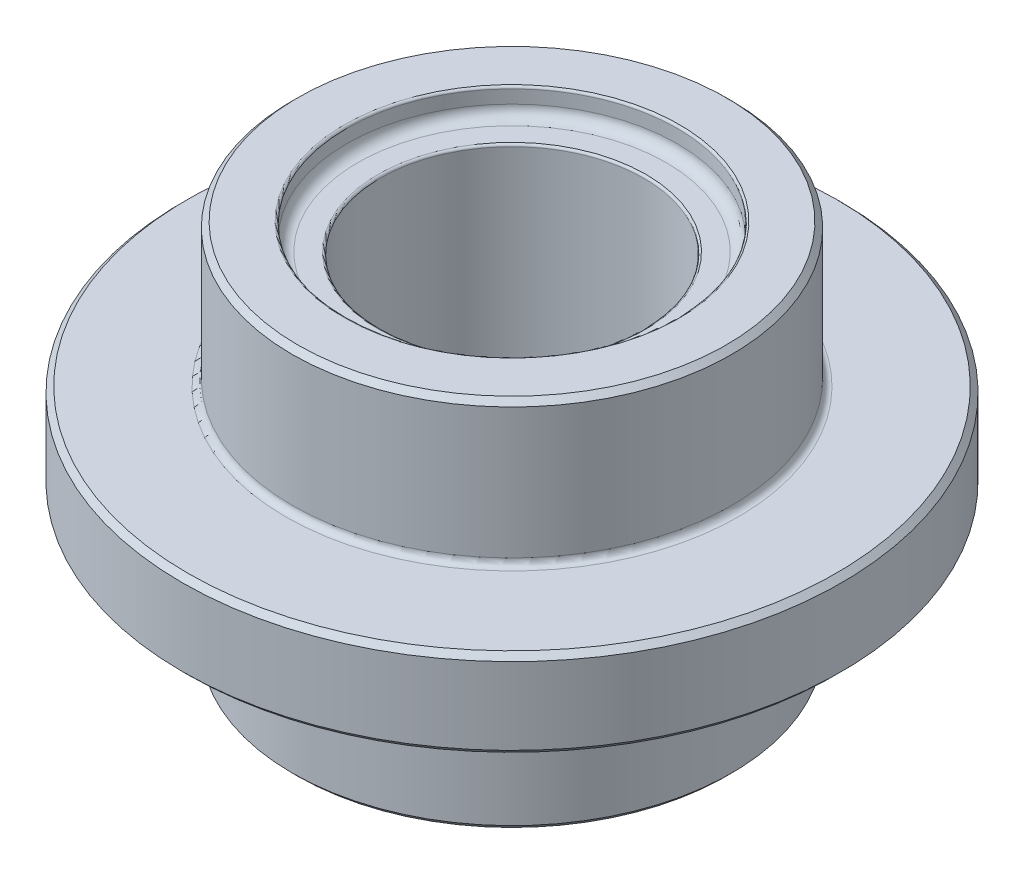
ISO-10303-21;
HEADER;
FILE_DESCRIPTION(('STEP AP214'),'2;1');
FILE_NAME('part.step','',(''),(''),'','','');
FILE_SCHEMA(('AUTOMOTIVE_DESIGN { 1 0 10303 214 1 1 1 1 }'));
ENDSEC;
DATA;
#1=APPLICATION_CONTEXT('core data for automotive mechanical design processes');
#2=APPLICATION_PROTOCOL_DEFINITION('international standard','automotive_design',2000,#1);
#3=PRODUCT_CONTEXT('',#1,'mechanical');
#4=PRODUCT('Part','Part','',(#3));
#5=PRODUCT_RELATED_PRODUCT_CATEGORY('part','',(#4));
#6=PRODUCT_DEFINITION_FORMATION('','',#4);
#7=PRODUCT_DEFINITION_CONTEXT('part definition',#1,'design');
#8=PRODUCT_DEFINITION('design','',#6,#7);
#9=PRODUCT_DEFINITION_SHAPE('','',#8);
#10=(LENGTH_UNIT() NAMED_UNIT(*) SI_UNIT(.MILLI.,.METRE.));
#11=(NAMED_UNIT(*) PLANE_ANGLE_UNIT() SI_UNIT($,.RADIAN.));
#12=(NAMED_UNIT(*) SI_UNIT($,.STERADIAN.) SOLID_ANGLE_UNIT());
#13=UNCERTAINTY_MEASURE_WITH_UNIT(LENGTH_MEASURE(1.E-05),#10,'distance_accuracy_value','');
#14=(GEOMETRIC_REPRESENTATION_CONTEXT(3) GLOBAL_UNCERTAINTY_ASSIGNED_CONTEXT((#13)) GLOBAL_UNIT_ASSIGNED_CONTEXT((#10,
#11,#12)) REPRESENTATION_CONTEXT('',''));
#15=CARTESIAN_POINT('',(0.,0.,0.));
#16=DIRECTION('',(0.,0.,1.));
#17=DIRECTION('',(1.,0.,0.));
#18=AXIS2_PLACEMENT_3D('',#15,#16,#17);
#19=CARTESIAN_POINT('',(0.,-17.,0.));
#20=DIRECTION('',(0.,1.,0.));
#21=DIRECTION('',(0.,0.,1.));
#22=AXIS2_PLACEMENT_3D('',#19,#20,#21);
#23=CYLINDRICAL_SURFACE('',#22,12.);
#24=CARTESIAN_POINT('',(0.,14.4,0.));
#25=DIRECTION('',(0.,1.,0.));
#26=DIRECTION('',(0.,0.,1.));
#27=AXIS2_PLACEMENT_3D('',#24,#25,#26);
#28=CIRCLE('',#27,12.);
#29=CARTESIAN_POINT('',(0.,14.4,12.));
#30=VERTEX_POINT('',#29);
#31=EDGE_CURVE('E41',#30,#30,#28,.T.);
#32=ORIENTED_EDGE('',*,*,#31,.T.);
#33=EDGE_LOOP('',(#32));
#34=FACE_BOUND('',#33,.T.);
#35=CARTESIAN_POINT('',(0.,-16.5,0.));
#36=DIRECTION('',(0.,1.,0.));
#37=DIRECTION('',(0.,0.,1.));
#38=AXIS2_PLACEMENT_3D('',#35,#36,#37);
#39=CIRCLE('',#38,12.);
#40=CARTESIAN_POINT('',(0.,-16.5,12.));
#41=VERTEX_POINT('',#40);
#42=EDGE_CURVE('E89',#41,#41,#39,.F.);
#43=ORIENTED_EDGE('',*,*,#42,.T.);
#44=EDGE_LOOP('',(#43));
#45=FACE_BOUND('',#44,.T.);
#46=ADVANCED_FACE('F30',(#34,#45),#23,.F.);
#47=CARTESIAN_POINT('',(0.,4.,0.));
#48=DIRECTION('',(0.,1.,0.));
#49=DIRECTION('',(0.,0.,1.));
#50=AXIS2_PLACEMENT_3D('',#47,#48,#49);
#51=PLANE('',#50);
#52=CARTESIAN_POINT('',(0.,4.,0.));
#53=DIRECTION('',(0.,1.,0.));
#54=DIRECTION('',(0.,0.,1.));
#55=AXIS2_PLACEMENT_3D('',#52,#53,#54);
#56=CIRCLE('',#55,20.6);
#57=CARTESIAN_POINT('',(0.,4.,20.6));
#58=VERTEX_POINT('',#57);
#59=EDGE_CURVE('E65',#58,#58,#56,.F.);
#60=ORIENTED_EDGE('',*,*,#59,.T.);
#61=EDGE_LOOP('',(#60));
#62=FACE_BOUND('',#61,.T.);
#63=CARTESIAN_POINT('',(0.,4.,0.));
#64=DIRECTION('',(0.,1.,0.));
#65=DIRECTION('',(0.,0.,1.));
#66=AXIS2_PLACEMENT_3D('',#63,#64,#65);
#67=CIRCLE('',#66,29.5);
#68=CARTESIAN_POINT('',(0.,4.,29.5));
#69=VERTEX_POINT('',#68);
#70=EDGE_CURVE('E74',#69,#69,#67,.T.);
#71=ORIENTED_EDGE('',*,*,#70,.T.);
#72=EDGE_LOOP('',(#71));
#73=FACE_BOUND('',#72,.T.);
#74=ADVANCED_FACE('F125',(#62,#73),#51,.T.);
#75=CARTESIAN_POINT('',(0.,-4.,0.));
#76=DIRECTION('',(0.,1.,0.));
#77=DIRECTION('',(0.,0.,1.));
#78=AXIS2_PLACEMENT_3D('',#75,#76,#77);
#79=PLANE('',#78);
#80=CARTESIAN_POINT('',(0.,-4.,0.));
#81=DIRECTION('',(0.,1.,0.));
#82=DIRECTION('',(0.,0.,1.));
#83=AXIS2_PLACEMENT_3D('',#80,#81,#82);
#84=CIRCLE('',#83,20.6);
#85=CARTESIAN_POINT('',(0.,-4.,20.6));
#86=VERTEX_POINT('',#85);
#87=EDGE_CURVE('E56',#86,#86,#84,.T.);
#88=ORIENTED_EDGE('',*,*,#87,.T.);
#89=EDGE_LOOP('',(#88));
#90=FACE_BOUND('',#89,.T.);
#91=CARTESIAN_POINT('',(0.,-4.,0.));
#92=DIRECTION('',(0.,1.,0.));
#93=DIRECTION('',(0.,0.,1.));
#94=AXIS2_PLACEMENT_3D('',#91,#92,#93);
#95=CIRCLE('',#94,29.5);
#96=CARTESIAN_POINT('',(0.,-4.,29.5));
#97=VERTEX_POINT('',#96);
#98=EDGE_CURVE('E77',#97,#97,#95,.F.);
#99=ORIENTED_EDGE('',*,*,#98,.T.);
#100=EDGE_LOOP('',(#99));
#101=FACE_BOUND('',#100,.T.);
#102=ADVANCED_FACE('F131',(#90,#101),#79,.F.);
#103=CARTESIAN_POINT('',(0.,4.,0.));
#104=DIRECTION('',(0.,-1.,0.));
#105=DIRECTION('',(0.,0.,-1.));
#106=AXIS2_PLACEMENT_3D('',#103,#104,#105);
#107=CYLINDRICAL_SURFACE('',#106,30.);
#108=CARTESIAN_POINT('',(0.,-3.5,0.));
#109=DIRECTION('',(0.,1.,0.));
#110=DIRECTION('',(0.,0.,1.));
#111=AXIS2_PLACEMENT_3D('',#108,#109,#110);
#112=CIRCLE('',#111,30.);
#113=CARTESIAN_POINT('',(0.,-3.5,30.));
#114=VERTEX_POINT('',#113);
#115=EDGE_CURVE('E80',#114,#114,#112,.T.);
#116=ORIENTED_EDGE('',*,*,#115,.T.);
#117=EDGE_LOOP('',(#116));
#118=FACE_BOUND('',#117,.T.);
#119=CARTESIAN_POINT('',(0.,3.49999999999999,0.));
#120=DIRECTION('',(0.,1.,0.));
#121=DIRECTION('',(0.,0.,1.));
#122=AXIS2_PLACEMENT_3D('',#119,#120,#121);
#123=CIRCLE('',#122,30.);
#124=CARTESIAN_POINT('',(0.,3.49999999999999,30.));
#125=VERTEX_POINT('',#124);
#126=EDGE_CURVE('E83',#125,#125,#123,.F.);
#127=ORIENTED_EDGE('',*,*,#126,.T.);
#128=EDGE_LOOP('',(#127));
#129=FACE_BOUND('',#128,.T.);
#130=ADVANCED_FACE('F32',(#118,#129),#107,.T.);
#131=CARTESIAN_POINT('',(0.,-17.,0.));
#132=DIRECTION('',(0.,1.,0.));
#133=DIRECTION('',(0.,0.,1.));
#134=AXIS2_PLACEMENT_3D('',#131,#132,#133);
#135=PLANE('',#134);
#136=CARTESIAN_POINT('',(0.,-17.,0.));
#137=DIRECTION('',(0.,1.,0.));
#138=DIRECTION('',(0.,0.,1.));
#139=AXIS2_PLACEMENT_3D('',#136,#137,#138);
#140=CIRCLE('',#139,12.5);
#141=CARTESIAN_POINT('',(0.,-17.,12.5));
#142=VERTEX_POINT('',#141);
#143=EDGE_CURVE('E92',#142,#142,#140,.T.);
#144=ORIENTED_EDGE('',*,*,#143,.T.);
#145=EDGE_LOOP('',(#144));
#146=FACE_BOUND('',#145,.T.);
#147=CARTESIAN_POINT('',(0.,-17.,0.));
#148=DIRECTION('',(0.,1.,0.));
#149=DIRECTION('',(0.,0.,1.));
#150=AXIS2_PLACEMENT_3D('',#147,#148,#149);
#151=CIRCLE('',#150,19.5);
#152=CARTESIAN_POINT('',(0.,-17.,19.5));
#153=VERTEX_POINT('',#152);
#154=EDGE_CURVE('E95',#153,#153,#151,.F.);
#155=ORIENTED_EDGE('',*,*,#154,.T.);
#156=EDGE_LOOP('',(#155));
#157=FACE_BOUND('',#156,.T.);
#158=ADVANCED_FACE('F99',(#146,#157),#135,.F.);
#159=CARTESIAN_POINT('',(0.,17.,0.));
#160=DIRECTION('',(0.,-1.,0.));
#161=DIRECTION('',(0.,0.,-1.));
#162=AXIS2_PLACEMENT_3D('',#159,#160,#161);
#163=CYLINDRICAL_SURFACE('',#162,20.);
#164=CARTESIAN_POINT('',(0.,-4.6,0.));
#165=DIRECTION('',(0.,1.,0.));
#166=DIRECTION('',(0.,0.,1.));
#167=AXIS2_PLACEMENT_3D('',#164,#165,#166);
#168=CIRCLE('',#167,20.);
#169=CARTESIAN_POINT('',(0.,-4.6,20.));
#170=VERTEX_POINT('',#169);
#171=EDGE_CURVE('E59',#170,#170,#168,.F.);
#172=ORIENTED_EDGE('',*,*,#171,.T.);
#173=EDGE_LOOP('',(#172));
#174=FACE_BOUND('',#173,.T.);
#175=CARTESIAN_POINT('',(0.,-16.5,0.));
#176=DIRECTION('',(0.,1.,0.));
#177=DIRECTION('',(0.,0.,1.));
#178=AXIS2_PLACEMENT_3D('',#175,#176,#177);
#179=CIRCLE('',#178,20.);
#180=CARTESIAN_POINT('',(0.,-16.5,20.));
#181=VERTEX_POINT('',#180);
#182=EDGE_CURVE('E86',#181,#181,#179,.T.);
#183=ORIENTED_EDGE('',*,*,#182,.T.);
#184=EDGE_LOOP('',(#183));
#185=FACE_BOUND('',#184,.T.);
#186=ADVANCED_FACE('F109',(#174,#185),#163,.T.);
#187=CARTESIAN_POINT('',(0.,4.6,0.));
#188=DIRECTION('',(0.,1.,0.));
#189=DIRECTION('',(0.,0.,1.));
#190=AXIS2_PLACEMENT_3D('',#187,#188,#189);
#191=CIRCLE('',#190,20.);
#192=CARTESIAN_POINT('',(0.,4.6,20.));
#193=VERTEX_POINT('',#192);
#194=EDGE_CURVE('E62',#193,#193,#191,.T.);
#195=ORIENTED_EDGE('',*,*,#194,.T.);
#196=EDGE_LOOP('',(#195));
#197=FACE_BOUND('',#196,.T.);
#198=CARTESIAN_POINT('',(0.,16.5,0.));
#199=DIRECTION('',(0.,1.,0.));
#200=DIRECTION('',(0.,0.,1.));
#201=AXIS2_PLACEMENT_3D('',#198,#199,#200);
#202=CIRCLE('',#201,20.);
#203=CARTESIAN_POINT('',(0.,16.5,20.));
#204=VERTEX_POINT('',#203);
#205=EDGE_CURVE('E68',#204,#204,#202,.F.);
#206=ORIENTED_EDGE('',*,*,#205,.T.);
#207=EDGE_LOOP('',(#206));
#208=FACE_BOUND('',#207,.T.);
#209=ADVANCED_FACE('F111',(#197,#208),#163,.T.);
#210=CARTESIAN_POINT('',(0.,17.,0.));
#211=DIRECTION('',(0.,1.,0.));
#212=DIRECTION('',(0.,0.,1.));
#213=AXIS2_PLACEMENT_3D('',#210,#211,#212);
#214=PLANE('',#213);
#215=CARTESIAN_POINT('',(0.,17.,0.));
#216=DIRECTION('',(0.,1.,0.));
#217=DIRECTION('',(0.,0.,1.));
#218=AXIS2_PLACEMENT_3D('',#215,#216,#217);
#219=CIRCLE('',#218,15.25);
#220=CARTESIAN_POINT('',(0.,17.,15.25));
#221=VERTEX_POINT('',#220);
#222=EDGE_CURVE('E50',#221,#221,#219,.F.);
#223=ORIENTED_EDGE('',*,*,#222,.T.);
#224=EDGE_LOOP('',(#223));
#225=FACE_BOUND('',#224,.T.);
#226=CARTESIAN_POINT('',(0.,17.,0.));
#227=DIRECTION('',(0.,1.,0.));
#228=DIRECTION('',(0.,0.,1.));
#229=AXIS2_PLACEMENT_3D('',#226,#227,#228);
#230=CIRCLE('',#229,19.5);
#231=CARTESIAN_POINT('',(0.,17.,19.5));
#232=VERTEX_POINT('',#231);
#233=EDGE_CURVE('E71',#232,#232,#230,.T.);
#234=ORIENTED_EDGE('',*,*,#233,.T.);
#235=EDGE_LOOP('',(#234));
#236=FACE_BOUND('',#235,.T.);
#237=ADVANCED_FACE('F118',(#225,#236),#214,.T.);
#238=CARTESIAN_POINT('',(0.,14.6,0.));
#239=DIRECTION('',(0.,1.,0.));
#240=DIRECTION('',(0.,0.,1.));
#241=AXIS2_PLACEMENT_3D('',#238,#239,#240);
#242=PLANE('',#241);
#243=CARTESIAN_POINT('',(0.,14.6,0.));
#244=DIRECTION('',(0.,1.,0.));
#245=DIRECTION('',(0.,0.,1.));
#246=AXIS2_PLACEMENT_3D('',#243,#244,#245);
#247=CIRCLE('',#246,14.05);
#248=CARTESIAN_POINT('',(0.,14.6,14.05));
#249=VERTEX_POINT('',#248);
#250=EDGE_CURVE('E37',#249,#249,#247,.T.);
#251=ORIENTED_EDGE('',*,*,#250,.T.);
#252=EDGE_LOOP('',(#251));
#253=FACE_BOUND('',#252,.T.);
#254=CARTESIAN_POINT('',(0.,14.6,0.));
#255=DIRECTION('',(0.,1.,0.));
#256=DIRECTION('',(0.,0.,1.));
#257=AXIS2_PLACEMENT_3D('',#254,#255,#256);
#258=CIRCLE('',#257,12.2);
#259=CARTESIAN_POINT('',(0.,14.6,12.2));
#260=VERTEX_POINT('',#259);
#261=EDGE_CURVE('E45',#260,#260,#258,.F.);
#262=ORIENTED_EDGE('',*,*,#261,.T.);
#263=EDGE_LOOP('',(#262));
#264=FACE_BOUND('',#263,.T.);
#265=ADVANCED_FACE('F138',(#253,#264),#242,.T.);
#266=CARTESIAN_POINT('',(0.,14.6,0.));
#267=DIRECTION('',(0.,1.,0.));
#268=DIRECTION('',(0.,0.,1.));
#269=AXIS2_PLACEMENT_3D('',#266,#267,#268);
#270=CYLINDRICAL_SURFACE('',#269,15.05);
#271=CARTESIAN_POINT('',(0.,15.6,0.));
#272=DIRECTION('',(0.,1.,0.));
#273=DIRECTION('',(0.,0.,1.));
#274=AXIS2_PLACEMENT_3D('',#271,#272,#273);
#275=CIRCLE('',#274,15.05);
#276=CARTESIAN_POINT('',(0.,15.6,15.05));
#277=VERTEX_POINT('',#276);
#278=EDGE_CURVE('E10',#277,#277,#275,.F.);
#279=ORIENTED_EDGE('',*,*,#278,.T.);
#280=EDGE_LOOP('',(#279));
#281=FACE_BOUND('',#280,.T.);
#282=CARTESIAN_POINT('',(0.,16.8,0.));
#283=DIRECTION('',(0.,1.,0.));
#284=DIRECTION('',(0.,0.,1.));
#285=AXIS2_PLACEMENT_3D('',#282,#283,#284);
#286=CIRCLE('',#285,15.05);
#287=CARTESIAN_POINT('',(0.,16.8,15.05));
#288=VERTEX_POINT('',#287);
#289=EDGE_CURVE('E53',#288,#288,#286,.T.);
#290=ORIENTED_EDGE('',*,*,#289,.T.);
#291=EDGE_LOOP('',(#290));
#292=FACE_BOUND('',#291,.T.);
#293=ADVANCED_FACE('F135',(#281,#292),#270,.F.);
#294=CARTESIAN_POINT('',(0.,-17.,0.));
#295=DIRECTION('',(0.,-1.,0.));
#296=DIRECTION('',(0.,0.,-1.));
#297=AXIS2_PLACEMENT_3D('',#294,#295,#296);
#298=CONICAL_SURFACE('',#297,12.5,0.785398163397445);
#299=ORIENTED_EDGE('',*,*,#42,.F.);
#300=EDGE_LOOP('',(#299));
#301=FACE_BOUND('',#300,.T.);
#302=ORIENTED_EDGE('',*,*,#143,.F.);
#303=EDGE_LOOP('',(#302));
#304=FACE_BOUND('',#303,.T.);
#305=ADVANCED_FACE('F105',(#301,#304),#298,.F.);
#306=CARTESIAN_POINT('',(0.,-16.5,0.));
#307=DIRECTION('',(0.,1.,0.));
#308=DIRECTION('',(0.,0.,1.));
#309=AXIS2_PLACEMENT_3D('',#306,#307,#308);
#310=CONICAL_SURFACE('',#309,20.,0.785398163397452);
#311=ORIENTED_EDGE('',*,*,#154,.F.);
#312=EDGE_LOOP('',(#311));
#313=FACE_BOUND('',#312,.T.);
#314=ORIENTED_EDGE('',*,*,#182,.F.);
#315=EDGE_LOOP('',(#314));
#316=FACE_BOUND('',#315,.T.);
#317=ADVANCED_FACE('F101',(#313,#316),#310,.T.);
#318=CARTESIAN_POINT('',(0.,-3.5,0.));
#319=DIRECTION('',(0.,1.,0.));
#320=DIRECTION('',(0.,0.,1.));
#321=AXIS2_PLACEMENT_3D('',#318,#319,#320);
#322=CONICAL_SURFACE('',#321,30.,0.785398163397448);
#323=ORIENTED_EDGE('',*,*,#98,.F.);
#324=EDGE_LOOP('',(#323));
#325=FACE_BOUND('',#324,.T.);
#326=ORIENTED_EDGE('',*,*,#115,.F.);
#327=EDGE_LOOP('',(#326));
#328=FACE_BOUND('',#327,.T.);
#329=ADVANCED_FACE('F104',(#325,#328),#322,.T.);
#330=CARTESIAN_POINT('',(0.,4.,0.));
#331=DIRECTION('',(0.,-1.,0.));
#332=DIRECTION('',(0.,0.,-1.));
#333=AXIS2_PLACEMENT_3D('',#330,#331,#332);
#334=CONICAL_SURFACE('',#333,29.5,0.785398163397441);
#335=ORIENTED_EDGE('',*,*,#126,.F.);
#336=EDGE_LOOP('',(#335));
#337=FACE_BOUND('',#336,.T.);
#338=ORIENTED_EDGE('',*,*,#70,.F.);
#339=EDGE_LOOP('',(#338));
#340=FACE_BOUND('',#339,.T.);
#341=ADVANCED_FACE('F150',(#337,#340),#334,.T.);
#342=CARTESIAN_POINT('',(0.,17.,0.));
#343=DIRECTION('',(0.,-1.,0.));
#344=DIRECTION('',(0.,0.,-1.));
#345=AXIS2_PLACEMENT_3D('',#342,#343,#344);
#346=CONICAL_SURFACE('',#345,19.5,0.785398163397441);
#347=ORIENTED_EDGE('',*,*,#205,.F.);
#348=EDGE_LOOP('',(#347));
#349=FACE_BOUND('',#348,.T.);
#350=ORIENTED_EDGE('',*,*,#233,.F.);
#351=EDGE_LOOP('',(#350));
#352=FACE_BOUND('',#351,.T.);
#353=ADVANCED_FACE('F147',(#349,#352),#346,.T.);
#354=CARTESIAN_POINT('',(0.,4.6,0.));
#355=DIRECTION('',(0.,1.,0.));
#356=DIRECTION('',(0.,0.,1.));
#357=AXIS2_PLACEMENT_3D('',#354,#355,#356);
#358=TOROIDAL_SURFACE('',#357,20.6,0.6);
#359=ORIENTED_EDGE('',*,*,#194,.F.);
#360=EDGE_LOOP('',(#359));
#361=FACE_BOUND('',#360,.T.);
#362=ORIENTED_EDGE('',*,*,#59,.F.);
#363=EDGE_LOOP('',(#362));
#364=FACE_BOUND('',#363,.T.);
#365=ADVANCED_FACE('F149',(#361,#364),#358,.F.);
#366=CARTESIAN_POINT('',(0.,-4.6,0.));
#367=DIRECTION('',(0.,1.,0.));
#368=DIRECTION('',(0.,0.,1.));
#369=AXIS2_PLACEMENT_3D('',#366,#367,#368);
#370=TOROIDAL_SURFACE('',#369,20.6,0.6);
#371=ORIENTED_EDGE('',*,*,#87,.F.);
#372=EDGE_LOOP('',(#371));
#373=FACE_BOUND('',#372,.T.);
#374=ORIENTED_EDGE('',*,*,#171,.F.);
#375=EDGE_LOOP('',(#374));
#376=FACE_BOUND('',#375,.T.);
#377=ADVANCED_FACE('F157',(#373,#376),#370,.F.);
#378=CARTESIAN_POINT('',(0.,16.8,0.));
#379=DIRECTION('',(0.,1.,0.));
#380=DIRECTION('',(0.,0.,1.));
#381=AXIS2_PLACEMENT_3D('',#378,#379,#380);
#382=TOROIDAL_SURFACE('',#381,15.25,0.2);
#383=ORIENTED_EDGE('',*,*,#222,.F.);
#384=EDGE_LOOP('',(#383));
#385=FACE_BOUND('',#384,.T.);
#386=ORIENTED_EDGE('',*,*,#289,.F.);
#387=EDGE_LOOP('',(#386));
#388=FACE_BOUND('',#387,.T.);
#389=ADVANCED_FACE('F181',(#385,#388),#382,.T.);
#390=CARTESIAN_POINT('',(0.,14.4,0.));
#391=DIRECTION('',(0.,1.,0.));
#392=DIRECTION('',(0.,0.,1.));
#393=AXIS2_PLACEMENT_3D('',#390,#391,#392);
#394=TOROIDAL_SURFACE('',#393,12.2,0.2);
#395=ORIENTED_EDGE('',*,*,#31,.F.);
#396=EDGE_LOOP('',(#395));
#397=FACE_BOUND('',#396,.T.);
#398=ORIENTED_EDGE('',*,*,#261,.F.);
#399=EDGE_LOOP('',(#398));
#400=FACE_BOUND('',#399,.T.);
#401=ADVANCED_FACE('F183',(#397,#400),#394,.T.);
#402=CARTESIAN_POINT('',(0.,15.6,0.));
#403=DIRECTION('',(0.,1.,0.));
#404=DIRECTION('',(0.,0.,1.));
#405=AXIS2_PLACEMENT_3D('',#402,#403,#404);
#406=TOROIDAL_SURFACE('',#405,14.05,1.);
#407=ORIENTED_EDGE('',*,*,#278,.F.);
#408=EDGE_LOOP('',(#407));
#409=FACE_BOUND('',#408,.T.);
#410=ORIENTED_EDGE('',*,*,#250,.F.);
#411=EDGE_LOOP('',(#410));
#412=FACE_BOUND('',#411,.T.);
#413=ADVANCED_FACE('F190',(#409,#412),#406,.F.);
#414=CLOSED_SHELL('',(#46,#74,#102,#130,#158,#186,#209,#237,#265,#293,#305,#317,#329,#341,#353,
#365,#377,#389,#401,#413));
#415=MANIFOLD_SOLID_BREP('B2',#414);
#416=ADVANCED_BREP_SHAPE_REPRESENTATION('',(#18,#415),#14);
#417=SHAPE_DEFINITION_REPRESENTATION(#9,#416);
ENDSEC;
END-ISO-10303-21;
